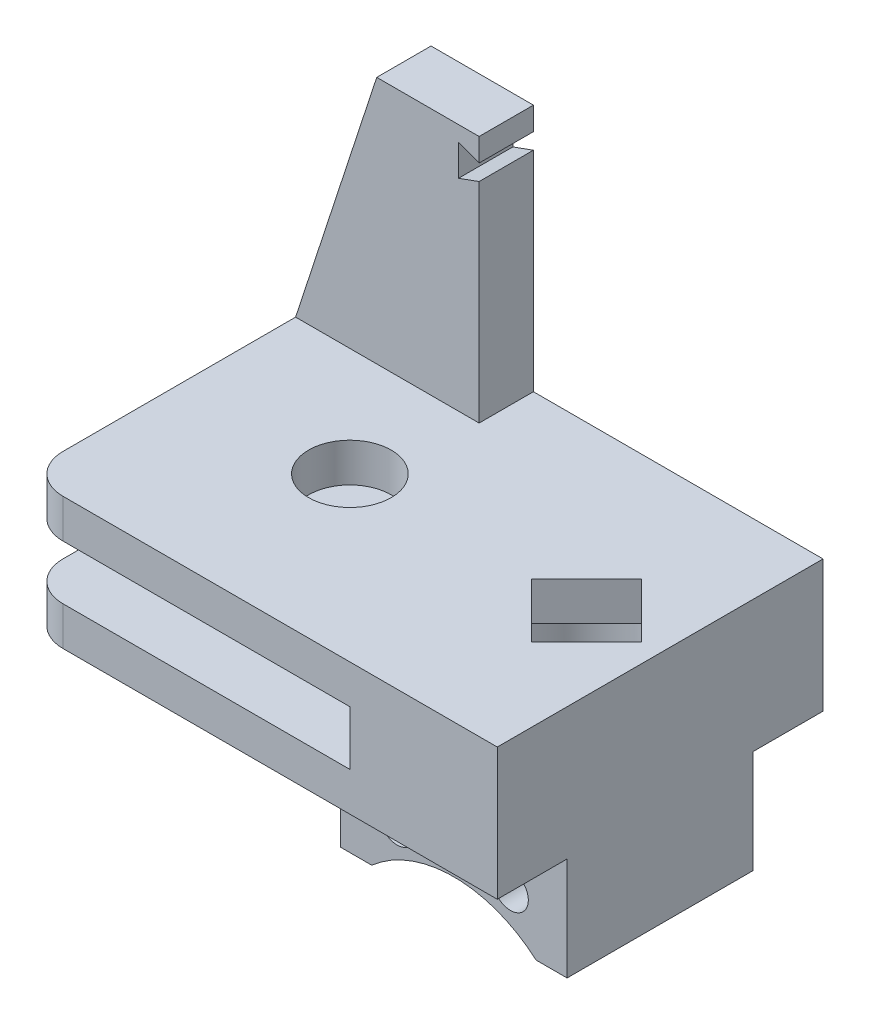
ISO-10303-21;
HEADER;
FILE_DESCRIPTION(('STEP AP214'),'2;1');
FILE_NAME('part.step','',(''),(''),'','','');
FILE_SCHEMA(('AUTOMOTIVE_DESIGN { 1 0 10303 214 1 1 1 1 }'));
ENDSEC;
DATA;
#1=APPLICATION_CONTEXT('core data for automotive mechanical design processes');
#2=APPLICATION_PROTOCOL_DEFINITION('international standard','automotive_design',2000,#1);
#3=PRODUCT_CONTEXT('',#1,'mechanical');
#4=PRODUCT('Part','Part','',(#3));
#5=PRODUCT_RELATED_PRODUCT_CATEGORY('part','',(#4));
#6=PRODUCT_DEFINITION_FORMATION('','',#4);
#7=PRODUCT_DEFINITION_CONTEXT('part definition',#1,'design');
#8=PRODUCT_DEFINITION('design','',#6,#7);
#9=PRODUCT_DEFINITION_SHAPE('','',#8);
#10=(LENGTH_UNIT() NAMED_UNIT(*) SI_UNIT(.MILLI.,.METRE.));
#11=(NAMED_UNIT(*) PLANE_ANGLE_UNIT() SI_UNIT($,.RADIAN.));
#12=(NAMED_UNIT(*) SI_UNIT($,.STERADIAN.) SOLID_ANGLE_UNIT());
#13=UNCERTAINTY_MEASURE_WITH_UNIT(LENGTH_MEASURE(1.E-05),#10,'distance_accuracy_value','');
#14=(GEOMETRIC_REPRESENTATION_CONTEXT(3) GLOBAL_UNCERTAINTY_ASSIGNED_CONTEXT((#13)) GLOBAL_UNIT_ASSIGNED_CONTEXT((#10,
#11,#12)) REPRESENTATION_CONTEXT('',''));
#15=CARTESIAN_POINT('',(0.,0.,0.));
#16=DIRECTION('',(0.,0.,1.));
#17=DIRECTION('',(1.,0.,0.));
#18=AXIS2_PLACEMENT_3D('',#15,#16,#17);
#19=CARTESIAN_POINT('',(1.6891,23.495,-13.335));
#20=DIRECTION('',(-1.,0.,0.));
#21=DIRECTION('',(0.,0.,1.));
#22=AXIS2_PLACEMENT_3D('',#19,#20,#21);
#23=PLANE('',#22);
#24=DIRECTION('',(0.,-1.,0.));
#25=VECTOR('',#24,1.);
#26=CARTESIAN_POINT('',(1.6891,23.495,-8.89));
#27=LINE('',#26,#25);
#28=CARTESIAN_POINT('',(1.6891,23.495,-8.89));
#29=VERTEX_POINT('',#28);
#30=CARTESIAN_POINT('',(1.6891,21.610217877301,-8.89));
#31=VERTEX_POINT('',#30);
#32=EDGE_CURVE('E244',#29,#31,#27,.T.);
#33=ORIENTED_EDGE('',*,*,#32,.T.);
#34=DIRECTION('',(0.,0.,1.));
#35=VECTOR('',#34,1.);
#36=CARTESIAN_POINT('',(1.6891,21.610217877301,-21.59));
#37=LINE('',#36,#35);
#38=CARTESIAN_POINT('',(1.6891,21.610217877301,-13.335));
#39=VERTEX_POINT('',#38);
#40=EDGE_CURVE('E238',#39,#31,#37,.T.);
#41=ORIENTED_EDGE('',*,*,#40,.F.);
#42=DIRECTION('',(0.,-1.,0.));
#43=VECTOR('',#42,1.);
#44=CARTESIAN_POINT('',(1.6891,23.495,-13.335));
#45=LINE('',#44,#43);
#46=CARTESIAN_POINT('',(1.6891,23.495,-13.335));
#47=VERTEX_POINT('',#46);
#48=EDGE_CURVE('E253',#47,#39,#45,.T.);
#49=ORIENTED_EDGE('',*,*,#48,.F.);
#50=DIRECTION('',(0.,0.,-1.));
#51=VECTOR('',#50,1.);
#52=CARTESIAN_POINT('',(1.6891,23.495,-13.335));
#53=LINE('',#52,#51);
#54=EDGE_CURVE('E839',#29,#47,#53,.T.);
#55=ORIENTED_EDGE('',*,*,#54,.F.);
#56=EDGE_LOOP('',(#33,#41,#49,#55));
#57=FACE_BOUND('',#56,.T.);
#58=ADVANCED_FACE('F37',(#57),#23,.F.);
#59=CARTESIAN_POINT('',(0.,3.175,0.));
#60=DIRECTION('',(0.,1.,0.));
#61=DIRECTION('',(0.,0.,1.));
#62=AXIS2_PLACEMENT_3D('',#59,#60,#61);
#63=PLANE('',#62);
#64=DIRECTION('',(-0.705213204342348,0.,0.708995300704594));
#65=VECTOR('',#64,1.);
#66=CARTESIAN_POINT('',(14.8774361673927,3.175,0.0240162260162808));
#67=LINE('',#66,#65);
#68=CARTESIAN_POINT('',(19.3675,3.175,-4.49012806053455));
#69=VERTEX_POINT('',#68);
#70=CARTESIAN_POINT('',(14.8774361673927,3.175,0.024016226016282));
#71=VERTEX_POINT('',#70);
#72=EDGE_CURVE('E290',#69,#71,#67,.T.);
#73=ORIENTED_EDGE('',*,*,#72,.F.);
#74=DIRECTION('',(-0.708995300704597,0.,-0.705213204342345));
#75=VECTOR('',#74,1.);
#76=CARTESIAN_POINT('',(23.8575638326073,3.175,-0.0240162260162793));
#77=LINE('',#76,#75);
#78=CARTESIAN_POINT('',(23.8575638326073,3.175,-0.0240162260162793));
#79=VERTEX_POINT('',#78);
#80=EDGE_CURVE('E299',#79,#69,#77,.T.);
#81=ORIENTED_EDGE('',*,*,#80,.F.);
#82=DIRECTION('',(0.705213204342346,0.,-0.708995300704596));
#83=VECTOR('',#82,1.);
#84=CARTESIAN_POINT('',(19.3675,3.175,4.49012806053458));
#85=LINE('',#84,#83);
#86=CARTESIAN_POINT('',(19.3675,3.175,4.49012806053458));
#87=VERTEX_POINT('',#86);
#88=EDGE_CURVE('E296',#87,#79,#85,.T.);
#89=ORIENTED_EDGE('',*,*,#88,.F.);
#90=DIRECTION('',(0.708995300704596,0.,0.705213204342346));
#91=VECTOR('',#90,1.);
#92=CARTESIAN_POINT('',(19.3675,3.175,4.49012806053458));
#93=LINE('',#92,#91);
#94=EDGE_CURVE('E293',#71,#87,#93,.T.);
#95=ORIENTED_EDGE('',*,*,#94,.F.);
#96=EDGE_LOOP('',(#73,#81,#89,#95));
#97=FACE_BOUND('',#96,.T.);
#98=CARTESIAN_POINT('',(0.,3.175,0.));
#99=DIRECTION('',(0.,1.,0.));
#100=DIRECTION('',(0.,0.,1.));
#101=AXIS2_PLACEMENT_3D('',#98,#99,#100);
#102=CIRCLE('',#101,3.3782);
#103=CARTESIAN_POINT('',(0.,3.175,3.3782));
#104=VERTEX_POINT('',#103);
#105=EDGE_CURVE('E393',#104,#104,#102,.T.);
#106=ORIENTED_EDGE('',*,*,#105,.F.);
#107=EDGE_LOOP('',(#106));
#108=FACE_BOUND('',#107,.T.);
#109=DIRECTION('',(0.,0.,1.));
#110=VECTOR('',#109,1.);
#111=CARTESIAN_POINT('',(-13.335,3.175,13.335));
#112=LINE('',#111,#110);
#113=CARTESIAN_POINT('',(-13.335,3.175,-8.89));
#114=VERTEX_POINT('',#113);
#115=CARTESIAN_POINT('',(-13.335,3.175,10.16));
#116=VERTEX_POINT('',#115);
#117=EDGE_CURVE('E260',#114,#116,#112,.T.);
#118=ORIENTED_EDGE('',*,*,#117,.T.);
#119=CARTESIAN_POINT('',(-10.16,3.175,10.16));
#120=DIRECTION('',(0.,1.,0.));
#121=DIRECTION('',(0.,0.,1.));
#122=AXIS2_PLACEMENT_3D('',#119,#120,#121);
#123=CIRCLE('',#122,3.175);
#124=CARTESIAN_POINT('',(-10.16,3.175,13.335));
#125=VERTEX_POINT('',#124);
#126=EDGE_CURVE('E45',#116,#125,#123,.T.);
#127=ORIENTED_EDGE('',*,*,#126,.T.);
#128=DIRECTION('',(1.,0.,0.));
#129=VECTOR('',#128,1.);
#130=CARTESIAN_POINT('',(0.,3.175,13.335));
#131=LINE('',#130,#129);
#132=CARTESIAN_POINT('',(25.4,3.175,13.335));
#133=VERTEX_POINT('',#132);
#134=EDGE_CURVE('E399',#125,#133,#131,.T.);
#135=ORIENTED_EDGE('',*,*,#134,.T.);
#136=DIRECTION('',(0.,0.,1.));
#137=VECTOR('',#136,1.);
#138=CARTESIAN_POINT('',(25.4,3.175,0.));
#139=LINE('',#138,#137);
#140=CARTESIAN_POINT('',(25.4,3.175,-13.335));
#141=VERTEX_POINT('',#140);
#142=EDGE_CURVE('E401',#141,#133,#139,.T.);
#143=ORIENTED_EDGE('',*,*,#142,.F.);
#144=DIRECTION('',(1.,0.,0.));
#145=VECTOR('',#144,1.);
#146=CARTESIAN_POINT('',(0.,3.175,-13.335));
#147=LINE('',#146,#145);
#148=CARTESIAN_POINT('',(1.6891,3.175,-13.335));
#149=VERTEX_POINT('',#148);
#150=EDGE_CURVE('E396',#149,#141,#147,.T.);
#151=ORIENTED_EDGE('',*,*,#150,.F.);
#152=DIRECTION('',(0.,0.,-1.));
#153=VECTOR('',#152,1.);
#154=CARTESIAN_POINT('',(1.6891,3.175,-13.335));
#155=LINE('',#154,#153);
#156=CARTESIAN_POINT('',(1.6891,3.175,-8.89));
#157=VERTEX_POINT('',#156);
#158=EDGE_CURVE('E844',#157,#149,#155,.T.);
#159=ORIENTED_EDGE('',*,*,#158,.F.);
#160=DIRECTION('',(1.,0.,0.));
#161=VECTOR('',#160,1.);
#162=CARTESIAN_POINT('',(1.6891,3.175,-8.89));
#163=LINE('',#162,#161);
#164=EDGE_CURVE('E243',#114,#157,#163,.T.);
#165=ORIENTED_EDGE('',*,*,#164,.F.);
#166=EDGE_LOOP('',(#118,#127,#135,#143,#151,#159,#165));
#167=FACE_BOUND('',#166,.T.);
#168=ADVANCED_FACE('F437',(#97,#108,#167),#63,.T.);
#169=CARTESIAN_POINT('',(0.,-16.05915,0.));
#170=DIRECTION('',(0.,-1.,0.));
#171=DIRECTION('',(0.,0.,-1.));
#172=AXIS2_PLACEMENT_3D('',#169,#170,#171);
#173=PLANE('',#172);
#174=DIRECTION('',(0.,0.,-1.));
#175=VECTOR('',#174,1.);
#176=CARTESIAN_POINT('',(9.40879166989593,-16.05915,13.335));
#177=LINE('',#176,#175);
#178=CARTESIAN_POINT('',(9.40879166989593,-16.05915,7.62000000000001));
#179=VERTEX_POINT('',#178);
#180=CARTESIAN_POINT('',(9.40879166989593,-16.05915,-7.62));
#181=VERTEX_POINT('',#180);
#182=EDGE_CURVE('E417',#179,#181,#177,.T.);
#183=ORIENTED_EDGE('',*,*,#182,.F.);
#184=DIRECTION('',(-1.,0.,0.));
#185=VECTOR('',#184,1.);
#186=CARTESIAN_POINT('',(25.4,-16.05915,7.62000000000001));
#187=LINE('',#186,#185);
#188=CARTESIAN_POINT('',(6.858,-16.05915,7.62000000000001));
#189=VERTEX_POINT('',#188);
#190=EDGE_CURVE('E331',#179,#189,#187,.T.);
#191=ORIENTED_EDGE('',*,*,#190,.T.);
#192=DIRECTION('',(0.,0.,-1.));
#193=VECTOR('',#192,1.);
#194=CARTESIAN_POINT('',(6.858,-16.05915,-7.62000000000001));
#195=LINE('',#194,#193);
#196=CARTESIAN_POINT('',(6.858,-16.05915,-7.62000000000001));
#197=VERTEX_POINT('',#196);
#198=EDGE_CURVE('E336',#189,#197,#195,.T.);
#199=ORIENTED_EDGE('',*,*,#198,.T.);
#200=DIRECTION('',(1.,0.,0.));
#201=VECTOR('',#200,1.);
#202=CARTESIAN_POINT('',(25.4,-16.05915,-7.62));
#203=LINE('',#202,#201);
#204=EDGE_CURVE('E339',#197,#181,#203,.T.);
#205=ORIENTED_EDGE('',*,*,#204,.T.);
#206=EDGE_LOOP('',(#183,#191,#199,#205));
#207=FACE_BOUND('',#206,.T.);
#208=ADVANCED_FACE('F497',(#207),#173,.T.);
#209=CARTESIAN_POINT('',(0.,3.175,-13.335));
#210=DIRECTION('',(0.,0.,-1.));
#211=DIRECTION('',(-1.,0.,0.));
#212=AXIS2_PLACEMENT_3D('',#209,#210,#211);
#213=PLANE('',#212);
#214=DIRECTION('',(0.93969262078591,-0.342020143325665,0.));
#215=VECTOR('',#214,1.);
#216=CARTESIAN_POINT('',(6.12255198226424,19.9965733207083,-13.335));
#217=LINE('',#216,#215);
#218=CARTESIAN_POINT('',(0.,22.225,-13.335));
#219=VERTEX_POINT('',#218);
#220=EDGE_CURVE('E849',#219,#39,#217,.T.);
#221=ORIENTED_EDGE('',*,*,#220,.F.);
#222=DIRECTION('',(0.,1.,0.));
#223=VECTOR('',#222,1.);
#224=CARTESIAN_POINT('',(0.,3.175,-13.335));
#225=LINE('',#224,#223);
#226=CARTESIAN_POINT('',(0.,19.685,-13.335));
#227=VERTEX_POINT('',#226);
#228=EDGE_CURVE('E845',#227,#219,#225,.T.);
#229=ORIENTED_EDGE('',*,*,#228,.F.);
#230=DIRECTION('',(-0.939692620785907,-0.342020143325672,0.));
#231=VECTOR('',#230,1.);
#232=CARTESIAN_POINT('',(-5.30621171796243,17.7536968779471,-13.335));
#233=LINE('',#232,#231);
#234=CARTESIAN_POINT('',(1.6891,20.299782122699,-13.335));
#235=VERTEX_POINT('',#234);
#236=EDGE_CURVE('E851',#235,#227,#233,.T.);
#237=ORIENTED_EDGE('',*,*,#236,.F.);
#238=EDGE_CURVE('E237',#235,#149,#45,.T.);
#239=ORIENTED_EDGE('',*,*,#238,.T.);
#240=ORIENTED_EDGE('',*,*,#150,.T.);
#241=DIRECTION('',(0.,-1.,0.));
#242=VECTOR('',#241,1.);
#243=CARTESIAN_POINT('',(25.4,3.175,-13.335));
#244=LINE('',#243,#242);
#245=CARTESIAN_POINT('',(25.4,-7.62,-13.335));
#246=VERTEX_POINT('',#245);
#247=EDGE_CURVE('E404',#141,#246,#244,.T.);
#248=ORIENTED_EDGE('',*,*,#247,.T.);
#249=DIRECTION('',(1.,0.,0.));
#250=VECTOR('',#249,1.);
#251=CARTESIAN_POINT('',(0.,-7.62,-13.335));
#252=LINE('',#251,#250);
#253=CARTESIAN_POINT('',(-13.335,-7.62,-13.335));
#254=VERTEX_POINT('',#253);
#255=EDGE_CURVE('E365',#254,#246,#252,.T.);
#256=ORIENTED_EDGE('',*,*,#255,.F.);
#257=DIRECTION('',(0.,-1.,0.));
#258=VECTOR('',#257,1.);
#259=CARTESIAN_POINT('',(-13.335,25.3729664799597,-13.335));
#260=LINE('',#259,#258);
#261=CARTESIAN_POINT('',(-13.335,-4.445,-13.335));
#262=VERTEX_POINT('',#261);
#263=EDGE_CURVE('E261',#262,#254,#260,.T.);
#264=ORIENTED_EDGE('',*,*,#263,.F.);
#265=DIRECTION('',(1.,0.,0.));
#266=VECTOR('',#265,1.);
#267=CARTESIAN_POINT('',(0.,-4.445,-13.335));
#268=LINE('',#267,#266);
#269=CARTESIAN_POINT('',(13.335,-4.445,-13.335));
#270=VERTEX_POINT('',#269);
#271=EDGE_CURVE('E377',#262,#270,#268,.T.);
#272=ORIENTED_EDGE('',*,*,#271,.T.);
#273=DIRECTION('',(0.,1.,0.));
#274=VECTOR('',#273,1.);
#275=CARTESIAN_POINT('',(13.335,-4.445,-13.335));
#276=LINE('',#275,#274);
#277=CARTESIAN_POINT('',(13.335,0.,-13.335));
#278=VERTEX_POINT('',#277);
#279=EDGE_CURVE('E384',#270,#278,#276,.T.);
#280=ORIENTED_EDGE('',*,*,#279,.T.);
#281=DIRECTION('',(1.,0.,0.));
#282=VECTOR('',#281,1.);
#283=CARTESIAN_POINT('',(0.,0.,-13.335));
#284=LINE('',#283,#282);
#285=CARTESIAN_POINT('',(-13.335,0.,-13.335));
#286=VERTEX_POINT('',#285);
#287=EDGE_CURVE('E407',#286,#278,#284,.T.);
#288=ORIENTED_EDGE('',*,*,#287,.F.);
#289=DIRECTION('',(0.,1.,0.));
#290=VECTOR('',#289,1.);
#291=CARTESIAN_POINT('',(-13.335,-29.8179664799598,-13.335));
#292=LINE('',#291,#290);
#293=CARTESIAN_POINT('',(-13.335,3.175,-13.335));
#294=VERTEX_POINT('',#293);
#295=EDGE_CURVE('E268',#286,#294,#292,.T.);
#296=ORIENTED_EDGE('',*,*,#295,.T.);
#297=DIRECTION('',(-0.310697570966931,-0.950508821313747,0.));
#298=VECTOR('',#297,1.);
#299=CARTESIAN_POINT('',(-6.6929,23.495,-13.335));
#300=LINE('',#299,#298);
#301=CARTESIAN_POINT('',(-6.6929,23.495,-13.335));
#302=VERTEX_POINT('',#301);
#303=EDGE_CURVE('E832',#302,#294,#300,.T.);
#304=ORIENTED_EDGE('',*,*,#303,.F.);
#305=DIRECTION('',(-1.,0.,0.));
#306=VECTOR('',#305,1.);
#307=CARTESIAN_POINT('',(1.6891,23.495,-13.335));
#308=LINE('',#307,#306);
#309=EDGE_CURVE('E835',#47,#302,#308,.T.);
#310=ORIENTED_EDGE('',*,*,#309,.F.);
#311=ORIENTED_EDGE('',*,*,#48,.T.);
#312=EDGE_LOOP('',(#221,#229,#237,#239,#240,#248,#256,#264,#272,#280,#288,#296,#304,#310,#311));
#313=FACE_BOUND('',#312,.T.);
#314=ADVANCED_FACE('F453',(#313),#213,.T.);
#315=CARTESIAN_POINT('',(0.,3.175,13.335));
#316=DIRECTION('',(0.,0.,-1.));
#317=DIRECTION('',(-1.,0.,0.));
#318=AXIS2_PLACEMENT_3D('',#315,#316,#317);
#319=PLANE('',#318);
#320=DIRECTION('',(1.,0.,0.));
#321=VECTOR('',#320,1.);
#322=CARTESIAN_POINT('',(0.,-4.445,13.335));
#323=LINE('',#322,#321);
#324=CARTESIAN_POINT('',(-10.16,-4.445,13.335));
#325=VERTEX_POINT('',#324);
#326=CARTESIAN_POINT('',(13.335,-4.445,13.335));
#327=VERTEX_POINT('',#326);
#328=EDGE_CURVE('E366',#325,#327,#323,.T.);
#329=ORIENTED_EDGE('',*,*,#328,.F.);
#330=DIRECTION('',(0.,-1.,0.));
#331=VECTOR('',#330,1.);
#332=CARTESIAN_POINT('',(-10.16,-7.62,13.335));
#333=LINE('',#332,#331);
#334=CARTESIAN_POINT('',(-10.16,-7.62,13.335));
#335=VERTEX_POINT('',#334);
#336=EDGE_CURVE('E424',#325,#335,#333,.T.);
#337=ORIENTED_EDGE('',*,*,#336,.T.);
#338=DIRECTION('',(1.,0.,0.));
#339=VECTOR('',#338,1.);
#340=CARTESIAN_POINT('',(0.,-7.62,13.335));
#341=LINE('',#340,#339);
#342=CARTESIAN_POINT('',(25.4,-7.62,13.335));
#343=VERTEX_POINT('',#342);
#344=EDGE_CURVE('E372',#335,#343,#341,.T.);
#345=ORIENTED_EDGE('',*,*,#344,.T.);
#346=DIRECTION('',(0.,-1.,0.));
#347=VECTOR('',#346,1.);
#348=CARTESIAN_POINT('',(25.4,3.175,13.335));
#349=LINE('',#348,#347);
#350=EDGE_CURVE('E412',#133,#343,#349,.T.);
#351=ORIENTED_EDGE('',*,*,#350,.F.);
#352=ORIENTED_EDGE('',*,*,#134,.F.);
#353=DIRECTION('',(0.,1.,0.));
#354=VECTOR('',#353,1.);
#355=CARTESIAN_POINT('',(-10.16,0.,13.335));
#356=LINE('',#355,#354);
#357=CARTESIAN_POINT('',(-10.16,0.,13.335));
#358=VERTEX_POINT('',#357);
#359=EDGE_CURVE('E422',#125,#358,#356,.F.);
#360=ORIENTED_EDGE('',*,*,#359,.T.);
#361=DIRECTION('',(1.,0.,0.));
#362=VECTOR('',#361,1.);
#363=CARTESIAN_POINT('',(0.,0.,13.335));
#364=LINE('',#363,#362);
#365=CARTESIAN_POINT('',(13.335,0.,13.335));
#366=VERTEX_POINT('',#365);
#367=EDGE_CURVE('E397',#358,#366,#364,.T.);
#368=ORIENTED_EDGE('',*,*,#367,.T.);
#369=DIRECTION('',(0.,1.,0.));
#370=VECTOR('',#369,1.);
#371=CARTESIAN_POINT('',(13.335,-4.445,13.335));
#372=LINE('',#371,#370);
#373=EDGE_CURVE('E387',#327,#366,#372,.T.);
#374=ORIENTED_EDGE('',*,*,#373,.F.);
#375=EDGE_LOOP('',(#329,#337,#345,#351,#352,#360,#368,#374));
#376=FACE_BOUND('',#375,.T.);
#377=ADVANCED_FACE('F443',(#376),#319,.F.);
#378=CARTESIAN_POINT('',(0.,3.175,0.));
#379=DIRECTION('',(0.,-1.,0.));
#380=DIRECTION('',(0.,0.,-1.));
#381=AXIS2_PLACEMENT_3D('',#378,#379,#380);
#382=CYLINDRICAL_SURFACE('',#381,3.3782);
#383=ORIENTED_EDGE('',*,*,#105,.T.);
#384=EDGE_LOOP('',(#383));
#385=FACE_BOUND('',#384,.T.);
#386=CARTESIAN_POINT('',(0.,0.,0.));
#387=DIRECTION('',(0.,1.,0.));
#388=DIRECTION('',(0.,0.,1.));
#389=AXIS2_PLACEMENT_3D('',#386,#387,#388);
#390=CIRCLE('',#389,3.3782);
#391=CARTESIAN_POINT('',(0.,0.,3.3782));
#392=VERTEX_POINT('',#391);
#393=EDGE_CURVE('E390',#392,#392,#390,.T.);
#394=ORIENTED_EDGE('',*,*,#393,.F.);
#395=EDGE_LOOP('',(#394));
#396=FACE_BOUND('',#395,.T.);
#397=ADVANCED_FACE('F695',(#385,#396),#382,.F.);
#398=CARTESIAN_POINT('',(25.4,3.175,0.));
#399=DIRECTION('',(1.,0.,0.));
#400=DIRECTION('',(0.,0.,-1.));
#401=AXIS2_PLACEMENT_3D('',#398,#399,#400);
#402=PLANE('',#401);
#403=ORIENTED_EDGE('',*,*,#350,.T.);
#404=DIRECTION('',(0.,0.,1.));
#405=VECTOR('',#404,1.);
#406=CARTESIAN_POINT('',(25.4,-7.62,0.));
#407=LINE('',#406,#405);
#408=CARTESIAN_POINT('',(25.4,-7.62,7.62000000000001));
#409=VERTEX_POINT('',#408);
#410=EDGE_CURVE('E369',#409,#343,#407,.T.);
#411=ORIENTED_EDGE('',*,*,#410,.F.);
#412=DIRECTION('',(0.,1.,0.));
#413=VECTOR('',#412,1.);
#414=CARTESIAN_POINT('',(25.4,-16.05915,7.62000000000001));
#415=LINE('',#414,#413);
#416=CARTESIAN_POINT('',(25.4,-16.05915,7.62000000000001));
#417=VERTEX_POINT('',#416);
#418=EDGE_CURVE('E358',#417,#409,#415,.T.);
#419=ORIENTED_EDGE('',*,*,#418,.F.);
#420=DIRECTION('',(0.,0.,1.));
#421=VECTOR('',#420,1.);
#422=CARTESIAN_POINT('',(25.4,-16.05915,-7.62));
#423=LINE('',#422,#421);
#424=CARTESIAN_POINT('',(25.4,-16.05915,-7.62));
#425=VERTEX_POINT('',#424);
#426=EDGE_CURVE('E328',#425,#417,#423,.T.);
#427=ORIENTED_EDGE('',*,*,#426,.F.);
#428=DIRECTION('',(0.,1.,0.));
#429=VECTOR('',#428,1.);
#430=CARTESIAN_POINT('',(25.4,-16.05915,-7.62));
#431=LINE('',#430,#429);
#432=CARTESIAN_POINT('',(25.4,-7.62,-7.62));
#433=VERTEX_POINT('',#432);
#434=EDGE_CURVE('E342',#425,#433,#431,.T.);
#435=ORIENTED_EDGE('',*,*,#434,.T.);
#436=EDGE_CURVE('E370',#246,#433,#407,.T.);
#437=ORIENTED_EDGE('',*,*,#436,.F.);
#438=ORIENTED_EDGE('',*,*,#247,.F.);
#439=ORIENTED_EDGE('',*,*,#142,.T.);
#440=EDGE_LOOP('',(#403,#411,#419,#427,#435,#437,#438,#439));
#441=FACE_BOUND('',#440,.T.);
#442=ADVANCED_FACE('F487',(#441),#402,.T.);
#443=CARTESIAN_POINT('',(0.,0.,0.));
#444=DIRECTION('',(0.,1.,0.));
#445=DIRECTION('',(0.,0.,1.));
#446=AXIS2_PLACEMENT_3D('',#443,#444,#445);
#447=PLANE('',#446);
#448=ORIENTED_EDGE('',*,*,#367,.F.);
#449=CARTESIAN_POINT('',(-10.16,0.,10.16));
#450=DIRECTION('',(0.,1.,0.));
#451=DIRECTION('',(0.,0.,1.));
#452=AXIS2_PLACEMENT_3D('',#449,#450,#451);
#453=CIRCLE('',#452,3.175);
#454=CARTESIAN_POINT('',(-13.335,0.,10.16));
#455=VERTEX_POINT('',#454);
#456=EDGE_CURVE('E11',#358,#455,#453,.F.);
#457=ORIENTED_EDGE('',*,*,#456,.T.);
#458=DIRECTION('',(0.,0.,-1.));
#459=VECTOR('',#458,1.);
#460=CARTESIAN_POINT('',(-13.335,0.,13.335));
#461=LINE('',#460,#459);
#462=EDGE_CURVE('E265',#455,#286,#461,.T.);
#463=ORIENTED_EDGE('',*,*,#462,.T.);
#464=ORIENTED_EDGE('',*,*,#287,.T.);
#465=DIRECTION('',(0.,0.,1.));
#466=VECTOR('',#465,1.);
#467=CARTESIAN_POINT('',(13.335,0.,0.));
#468=LINE('',#467,#466);
#469=EDGE_CURVE('E374',#278,#366,#468,.T.);
#470=ORIENTED_EDGE('',*,*,#469,.T.);
#471=EDGE_LOOP('',(#448,#457,#463,#464,#470));
#472=FACE_BOUND('',#471,.T.);
#473=ORIENTED_EDGE('',*,*,#393,.T.);
#474=EDGE_LOOP('',(#473));
#475=FACE_BOUND('',#474,.T.);
#476=ADVANCED_FACE('F449',(#472,#475),#447,.F.);
#477=CARTESIAN_POINT('',(13.335,-4.445,0.));
#478=DIRECTION('',(-1.,0.,0.));
#479=DIRECTION('',(0.,0.,1.));
#480=AXIS2_PLACEMENT_3D('',#477,#478,#479);
#481=PLANE('',#480);
#482=ORIENTED_EDGE('',*,*,#469,.F.);
#483=ORIENTED_EDGE('',*,*,#279,.F.);
#484=DIRECTION('',(0.,0.,-1.));
#485=VECTOR('',#484,1.);
#486=CARTESIAN_POINT('',(13.335,-4.445,0.));
#487=LINE('',#486,#485);
#488=EDGE_CURVE('E381',#327,#270,#487,.T.);
#489=ORIENTED_EDGE('',*,*,#488,.F.);
#490=ORIENTED_EDGE('',*,*,#373,.T.);
#491=EDGE_LOOP('',(#482,#483,#489,#490));
#492=FACE_BOUND('',#491,.T.);
#493=ADVANCED_FACE('F457',(#492),#481,.T.);
#494=CARTESIAN_POINT('',(0.,-4.445,0.));
#495=DIRECTION('',(0.,-1.,0.));
#496=DIRECTION('',(0.,0.,1.));
#497=AXIS2_PLACEMENT_3D('',#494,#495,#496);
#498=PLANE('',#497);
#499=DIRECTION('',(0.,0.,1.));
#500=VECTOR('',#499,1.);
#501=CARTESIAN_POINT('',(-13.335,-4.445,-13.335));
#502=LINE('',#501,#500);
#503=CARTESIAN_POINT('',(-13.335,-4.445,10.16));
#504=VERTEX_POINT('',#503);
#505=EDGE_CURVE('E257',#262,#504,#502,.T.);
#506=ORIENTED_EDGE('',*,*,#505,.T.);
#507=CARTESIAN_POINT('',(-10.16,-4.445,10.16));
#508=DIRECTION('',(0.,-1.,0.));
#509=DIRECTION('',(0.,0.,-1.));
#510=AXIS2_PLACEMENT_3D('',#507,#508,#509);
#511=CIRCLE('',#510,3.175);
#512=EDGE_CURVE('E431',#504,#325,#511,.F.);
#513=ORIENTED_EDGE('',*,*,#512,.T.);
#514=ORIENTED_EDGE('',*,*,#328,.T.);
#515=ORIENTED_EDGE('',*,*,#488,.T.);
#516=ORIENTED_EDGE('',*,*,#271,.F.);
#517=EDGE_LOOP('',(#506,#513,#514,#515,#516));
#518=FACE_BOUND('',#517,.T.);
#519=CARTESIAN_POINT('',(0.,-4.445,0.));
#520=DIRECTION('',(0.,1.,0.));
#521=DIRECTION('',(0.,0.,1.));
#522=AXIS2_PLACEMENT_3D('',#519,#520,#521);
#523=CIRCLE('',#522,3.3782);
#524=CARTESIAN_POINT('',(0.,-4.445,3.3782));
#525=VERTEX_POINT('',#524);
#526=EDGE_CURVE('E361',#525,#525,#523,.T.);
#527=ORIENTED_EDGE('',*,*,#526,.F.);
#528=EDGE_LOOP('',(#527));
#529=FACE_BOUND('',#528,.T.);
#530=ADVANCED_FACE('F460',(#518,#529),#498,.F.);
#531=CARTESIAN_POINT('',(0.,-7.62,0.));
#532=DIRECTION('',(0.,1.,0.));
#533=DIRECTION('',(0.,0.,1.));
#534=AXIS2_PLACEMENT_3D('',#531,#532,#533);
#535=CYLINDRICAL_SURFACE('',#534,3.3782);
#536=CARTESIAN_POINT('',(0.,-7.62,0.));
#537=DIRECTION('',(0.,1.,0.));
#538=DIRECTION('',(0.,0.,1.));
#539=AXIS2_PLACEMENT_3D('',#536,#537,#538);
#540=CIRCLE('',#539,3.3782);
#541=CARTESIAN_POINT('',(0.,-7.62,3.3782));
#542=VERTEX_POINT('',#541);
#543=EDGE_CURVE('E362',#542,#542,#540,.T.);
#544=ORIENTED_EDGE('',*,*,#543,.F.);
#545=EDGE_LOOP('',(#544));
#546=FACE_BOUND('',#545,.T.);
#547=ORIENTED_EDGE('',*,*,#526,.T.);
#548=EDGE_LOOP('',(#547));
#549=FACE_BOUND('',#548,.T.);
#550=ADVANCED_FACE('F704',(#546,#549),#535,.F.);
#551=CARTESIAN_POINT('',(0.,-7.62,0.));
#552=DIRECTION('',(0.,-1.,0.));
#553=DIRECTION('',(0.,0.,1.));
#554=AXIS2_PLACEMENT_3D('',#551,#552,#553);
#555=PLANE('',#554);
#556=ORIENTED_EDGE('',*,*,#344,.F.);
#557=CARTESIAN_POINT('',(-10.16,-7.62,10.16));
#558=DIRECTION('',(0.,-1.,0.));
#559=DIRECTION('',(0.,0.,-1.));
#560=AXIS2_PLACEMENT_3D('',#557,#558,#559);
#561=CIRCLE('',#560,3.175);
#562=CARTESIAN_POINT('',(-13.335,-7.62,10.16));
#563=VERTEX_POINT('',#562);
#564=EDGE_CURVE('E427',#335,#563,#561,.T.);
#565=ORIENTED_EDGE('',*,*,#564,.T.);
#566=DIRECTION('',(0.,0.,-1.));
#567=VECTOR('',#566,1.);
#568=CARTESIAN_POINT('',(-13.335,-7.62,-13.335));
#569=LINE('',#568,#567);
#570=EDGE_CURVE('E256',#563,#254,#569,.T.);
#571=ORIENTED_EDGE('',*,*,#570,.T.);
#572=ORIENTED_EDGE('',*,*,#255,.T.);
#573=ORIENTED_EDGE('',*,*,#436,.T.);
#574=DIRECTION('',(1.,0.,0.));
#575=VECTOR('',#574,1.);
#576=CARTESIAN_POINT('',(25.4,-7.62,-7.62));
#577=LINE('',#576,#575);
#578=CARTESIAN_POINT('',(6.858,-7.62,-7.62000000000001));
#579=VERTEX_POINT('',#578);
#580=EDGE_CURVE('E332',#579,#433,#577,.T.);
#581=ORIENTED_EDGE('',*,*,#580,.F.);
#582=DIRECTION('',(0.,0.,-1.));
#583=VECTOR('',#582,1.);
#584=CARTESIAN_POINT('',(6.858,-7.62,-7.62000000000001));
#585=LINE('',#584,#583);
#586=CARTESIAN_POINT('',(6.858,-7.62,7.62000000000001));
#587=VERTEX_POINT('',#586);
#588=EDGE_CURVE('E345',#587,#579,#585,.T.);
#589=ORIENTED_EDGE('',*,*,#588,.F.);
#590=DIRECTION('',(-1.,0.,0.));
#591=VECTOR('',#590,1.);
#592=CARTESIAN_POINT('',(25.4,-7.62,7.62000000000001));
#593=LINE('',#592,#591);
#594=EDGE_CURVE('E327',#409,#587,#593,.T.);
#595=ORIENTED_EDGE('',*,*,#594,.F.);
#596=ORIENTED_EDGE('',*,*,#410,.T.);
#597=EDGE_LOOP('',(#556,#565,#571,#572,#573,#581,#589,#595,#596));
#598=FACE_BOUND('',#597,.T.);
#599=ORIENTED_EDGE('',*,*,#543,.T.);
#600=EDGE_LOOP('',(#599));
#601=FACE_BOUND('',#600,.T.);
#602=ADVANCED_FACE('F471',(#598,#601),#555,.T.);
#603=CARTESIAN_POINT('',(25.4,-16.05915,7.62000000000001));
#604=DIRECTION('',(0.,0.,-1.));
#605=DIRECTION('',(-1.,0.,0.));
#606=AXIS2_PLACEMENT_3D('',#603,#604,#605);
#607=PLANE('',#606);
#608=CARTESIAN_POINT('',(20.7645,-12.1285,7.62000000000001));
#609=DIRECTION('',(0.,0.,-1.));
#610=DIRECTION('',(-1.,0.,0.));
#611=AXIS2_PLACEMENT_3D('',#608,#609,#610);
#612=CIRCLE('',#611,1.4605);
#613=CARTESIAN_POINT('',(19.304,-12.1285,7.62000000000001));
#614=VERTEX_POINT('',#613);
#615=EDGE_CURVE('E324',#614,#614,#612,.T.);
#616=ORIENTED_EDGE('',*,*,#615,.T.);
#617=EDGE_LOOP('',(#616));
#618=FACE_BOUND('',#617,.T.);
#619=CARTESIAN_POINT('',(11.4935,-12.1285,7.62000000000001));
#620=DIRECTION('',(0.,0.,-1.));
#621=DIRECTION('',(-1.,0.,0.));
#622=AXIS2_PLACEMENT_3D('',#619,#620,#621);
#623=CIRCLE('',#622,1.4605);
#624=CARTESIAN_POINT('',(10.033,-12.1285,7.62000000000001));
#625=VERTEX_POINT('',#624);
#626=EDGE_CURVE('E319',#625,#625,#623,.T.);
#627=ORIENTED_EDGE('',*,*,#626,.T.);
#628=EDGE_LOOP('',(#627));
#629=FACE_BOUND('',#628,.T.);
#630=ORIENTED_EDGE('',*,*,#190,.F.);
#631=CARTESIAN_POINT('',(16.129,-23.67915,7.62000000000001));
#632=DIRECTION('',(0.,0.,-1.));
#633=DIRECTION('',(-1.,0.,0.));
#634=AXIS2_PLACEMENT_3D('',#631,#632,#633);
#635=CIRCLE('',#634,10.16);
#636=CARTESIAN_POINT('',(22.8492083301041,-16.05915,7.62000000000001));
#637=VERTEX_POINT('',#636);
#638=EDGE_CURVE('E312',#179,#637,#635,.T.);
#639=ORIENTED_EDGE('',*,*,#638,.T.);
#640=EDGE_CURVE('E333',#417,#637,#187,.T.);
#641=ORIENTED_EDGE('',*,*,#640,.F.);
#642=ORIENTED_EDGE('',*,*,#418,.T.);
#643=ORIENTED_EDGE('',*,*,#594,.T.);
#644=DIRECTION('',(0.,1.,0.));
#645=VECTOR('',#644,1.);
#646=CARTESIAN_POINT('',(6.858,-16.05915,7.62000000000001));
#647=LINE('',#646,#645);
#648=EDGE_CURVE('E355',#189,#587,#647,.T.);
#649=ORIENTED_EDGE('',*,*,#648,.F.);
#650=EDGE_LOOP('',(#630,#639,#641,#642,#643,#649));
#651=FACE_BOUND('',#650,.T.);
#652=ADVANCED_FACE('F504',(#618,#629,#651),#607,.F.);
#653=CARTESIAN_POINT('',(6.858,-16.05915,-7.62000000000001));
#654=DIRECTION('',(1.,0.,0.));
#655=DIRECTION('',(0.,0.,-1.));
#656=AXIS2_PLACEMENT_3D('',#653,#654,#655);
#657=PLANE('',#656);
#658=ORIENTED_EDGE('',*,*,#588,.T.);
#659=DIRECTION('',(0.,1.,0.));
#660=VECTOR('',#659,1.);
#661=CARTESIAN_POINT('',(6.858,-16.05915,-7.62000000000001));
#662=LINE('',#661,#660);
#663=EDGE_CURVE('E352',#197,#579,#662,.T.);
#664=ORIENTED_EDGE('',*,*,#663,.F.);
#665=ORIENTED_EDGE('',*,*,#198,.F.);
#666=ORIENTED_EDGE('',*,*,#648,.T.);
#667=EDGE_LOOP('',(#658,#664,#665,#666));
#668=FACE_BOUND('',#667,.T.);
#669=ADVANCED_FACE('F502',(#668),#657,.F.);
#670=CARTESIAN_POINT('',(25.4,-16.05915,-7.62));
#671=DIRECTION('',(0.,0.,1.));
#672=DIRECTION('',(1.,0.,0.));
#673=AXIS2_PLACEMENT_3D('',#670,#671,#672);
#674=PLANE('',#673);
#675=CARTESIAN_POINT('',(20.7645,-12.1285,-7.62));
#676=DIRECTION('',(0.,0.,-1.));
#677=DIRECTION('',(-1.,0.,0.));
#678=AXIS2_PLACEMENT_3D('',#675,#676,#677);
#679=CIRCLE('',#678,1.4605);
#680=CARTESIAN_POINT('',(19.304,-12.1285,-7.62));
#681=VERTEX_POINT('',#680);
#682=EDGE_CURVE('E316',#681,#681,#679,.T.);
#683=ORIENTED_EDGE('',*,*,#682,.F.);
#684=EDGE_LOOP('',(#683));
#685=FACE_BOUND('',#684,.T.);
#686=CARTESIAN_POINT('',(11.4935,-12.1285,-7.62));
#687=DIRECTION('',(0.,0.,-1.));
#688=DIRECTION('',(1.,0.,0.));
#689=AXIS2_PLACEMENT_3D('',#686,#687,#688);
#690=CIRCLE('',#689,1.4605);
#691=CARTESIAN_POINT('',(12.954,-12.1285,-7.62));
#692=VERTEX_POINT('',#691);
#693=EDGE_CURVE('E315',#692,#692,#690,.T.);
#694=ORIENTED_EDGE('',*,*,#693,.F.);
#695=EDGE_LOOP('',(#694));
#696=FACE_BOUND('',#695,.T.);
#697=CARTESIAN_POINT('',(22.8492083301041,-16.05915,-7.62));
#698=VERTEX_POINT('',#697);
#699=EDGE_CURVE('E338',#698,#425,#203,.T.);
#700=ORIENTED_EDGE('',*,*,#699,.F.);
#701=CARTESIAN_POINT('',(16.129,-23.67915,-7.62));
#702=DIRECTION('',(0.,0.,-1.));
#703=DIRECTION('',(-1.,0.,0.));
#704=AXIS2_PLACEMENT_3D('',#701,#702,#703);
#705=CIRCLE('',#704,10.16);
#706=EDGE_CURVE('E305',#181,#698,#705,.T.);
#707=ORIENTED_EDGE('',*,*,#706,.F.);
#708=ORIENTED_EDGE('',*,*,#204,.F.);
#709=ORIENTED_EDGE('',*,*,#663,.T.);
#710=ORIENTED_EDGE('',*,*,#580,.T.);
#711=ORIENTED_EDGE('',*,*,#434,.F.);
#712=EDGE_LOOP('',(#700,#707,#708,#709,#710,#711));
#713=FACE_BOUND('',#712,.T.);
#714=ADVANCED_FACE('F483',(#685,#696,#713),#674,.F.);
#715=DIRECTION('',(0.,0.,-1.));
#716=VECTOR('',#715,1.);
#717=CARTESIAN_POINT('',(22.8492083301041,-16.05915,13.335));
#718=LINE('',#717,#716);
#719=EDGE_CURVE('E415',#698,#637,#718,.F.);
#720=ORIENTED_EDGE('',*,*,#719,.F.);
#721=ORIENTED_EDGE('',*,*,#699,.T.);
#722=ORIENTED_EDGE('',*,*,#426,.T.);
#723=ORIENTED_EDGE('',*,*,#640,.T.);
#724=EDGE_LOOP('',(#720,#721,#722,#723));
#725=FACE_BOUND('',#724,.T.);
#726=ADVANCED_FACE('F492',(#725),#173,.T.);
#727=CARTESIAN_POINT('',(11.4935,-12.1285,13.335));
#728=DIRECTION('',(0.,0.,-1.));
#729=DIRECTION('',(-1.,0.,0.));
#730=AXIS2_PLACEMENT_3D('',#727,#728,#729);
#731=CYLINDRICAL_SURFACE('',#730,1.4605);
#732=ORIENTED_EDGE('',*,*,#693,.T.);
#733=EDGE_LOOP('',(#732));
#734=FACE_BOUND('',#733,.T.);
#735=ORIENTED_EDGE('',*,*,#626,.F.);
#736=EDGE_LOOP('',(#735));
#737=FACE_BOUND('',#736,.T.);
#738=ADVANCED_FACE('F517',(#734,#737),#731,.F.);
#739=CARTESIAN_POINT('',(20.7645,-12.1285,13.335));
#740=DIRECTION('',(0.,0.,-1.));
#741=DIRECTION('',(-1.,0.,0.));
#742=AXIS2_PLACEMENT_3D('',#739,#740,#741);
#743=CYLINDRICAL_SURFACE('',#742,1.4605);
#744=ORIENTED_EDGE('',*,*,#682,.T.);
#745=EDGE_LOOP('',(#744));
#746=FACE_BOUND('',#745,.T.);
#747=ORIENTED_EDGE('',*,*,#615,.F.);
#748=EDGE_LOOP('',(#747));
#749=FACE_BOUND('',#748,.T.);
#750=ADVANCED_FACE('F508',(#746,#749),#743,.F.);
#751=CARTESIAN_POINT('',(16.129,-23.67915,13.335));
#752=DIRECTION('',(0.,0.,-1.));
#753=DIRECTION('',(-1.,0.,0.));
#754=AXIS2_PLACEMENT_3D('',#751,#752,#753);
#755=CYLINDRICAL_SURFACE('',#754,10.16);
#756=ORIENTED_EDGE('',*,*,#182,.T.);
#757=ORIENTED_EDGE('',*,*,#706,.T.);
#758=ORIENTED_EDGE('',*,*,#719,.T.);
#759=ORIENTED_EDGE('',*,*,#638,.F.);
#760=EDGE_LOOP('',(#756,#757,#758,#759));
#761=FACE_BOUND('',#760,.T.);
#762=ADVANCED_FACE('F505',(#761),#755,.F.);
#763=CARTESIAN_POINT('',(14.8774361673927,-6.35,0.0240162260162808));
#764=DIRECTION('',(-0.708995300704594,0.,-0.705213204342348));
#765=DIRECTION('',(-0.705213204342348,0.,0.708995300704594));
#766=AXIS2_PLACEMENT_3D('',#763,#764,#765);
#767=PLANE('',#766);
#768=DIRECTION('',(0.,1.,0.));
#769=VECTOR('',#768,1.);
#770=CARTESIAN_POINT('',(14.8774361673927,-6.35,0.0240162260162808));
#771=LINE('',#770,#769);
#772=CARTESIAN_POINT('',(14.8774361673927,0.,0.0240162260162808));
#773=VERTEX_POINT('',#772);
#774=EDGE_CURVE('E302',#773,#71,#771,.T.);
#775=ORIENTED_EDGE('',*,*,#774,.F.);
#776=DIRECTION('',(0.705213204342348,0.,-0.708995300704594));
#777=VECTOR('',#776,1.);
#778=CARTESIAN_POINT('',(14.8774361673927,0.,0.0240162260162808));
#779=LINE('',#778,#777);
#780=CARTESIAN_POINT('',(19.3675,0.,-4.49012806053455));
#781=VERTEX_POINT('',#780);
#782=EDGE_CURVE('E287',#773,#781,#779,.T.);
#783=ORIENTED_EDGE('',*,*,#782,.T.);
#784=DIRECTION('',(0.,1.,0.));
#785=VECTOR('',#784,1.);
#786=CARTESIAN_POINT('',(19.3675,-6.35,-4.49012806053455));
#787=LINE('',#786,#785);
#788=EDGE_CURVE('E303',#781,#69,#787,.T.);
#789=ORIENTED_EDGE('',*,*,#788,.T.);
#790=ORIENTED_EDGE('',*,*,#72,.T.);
#791=EDGE_LOOP('',(#775,#783,#789,#790));
#792=FACE_BOUND('',#791,.T.);
#793=ADVANCED_FACE('F507',(#792),#767,.F.);
#794=CARTESIAN_POINT('',(23.8575638326073,-6.35,-0.0240162260162793));
#795=DIRECTION('',(0.705213204342345,0.,-0.708995300704597));
#796=DIRECTION('',(-0.708995300704597,0.,-0.705213204342345));
#797=AXIS2_PLACEMENT_3D('',#794,#795,#796);
#798=PLANE('',#797);
#799=ORIENTED_EDGE('',*,*,#788,.F.);
#800=DIRECTION('',(0.708995300704597,0.,0.705213204342345));
#801=VECTOR('',#800,1.);
#802=CARTESIAN_POINT('',(23.8575638326073,0.,-0.0240162260162793));
#803=LINE('',#802,#801);
#804=CARTESIAN_POINT('',(23.8575638326073,0.,-0.0240162260162569));
#805=VERTEX_POINT('',#804);
#806=EDGE_CURVE('E284',#781,#805,#803,.T.);
#807=ORIENTED_EDGE('',*,*,#806,.T.);
#808=DIRECTION('',(0.,1.,0.));
#809=VECTOR('',#808,1.);
#810=CARTESIAN_POINT('',(23.8575638326073,-6.35,-0.0240162260162793));
#811=LINE('',#810,#809);
#812=EDGE_CURVE('E306',#805,#79,#811,.T.);
#813=ORIENTED_EDGE('',*,*,#812,.T.);
#814=ORIENTED_EDGE('',*,*,#80,.T.);
#815=EDGE_LOOP('',(#799,#807,#813,#814));
#816=FACE_BOUND('',#815,.T.);
#817=ADVANCED_FACE('F514',(#816),#798,.F.);
#818=CARTESIAN_POINT('',(19.3675,-6.35,4.49012806053458));
#819=DIRECTION('',(0.708995300704596,0.,0.705213204342346));
#820=DIRECTION('',(0.705213204342346,0.,-0.708995300704596));
#821=AXIS2_PLACEMENT_3D('',#818,#819,#820);
#822=PLANE('',#821);
#823=ORIENTED_EDGE('',*,*,#812,.F.);
#824=DIRECTION('',(-0.705213204342346,0.,0.708995300704596));
#825=VECTOR('',#824,1.);
#826=CARTESIAN_POINT('',(19.3675,0.,4.49012806053458));
#827=LINE('',#826,#825);
#828=CARTESIAN_POINT('',(19.3675,0.,4.49012806053455));
#829=VERTEX_POINT('',#828);
#830=EDGE_CURVE('E277',#805,#829,#827,.T.);
#831=ORIENTED_EDGE('',*,*,#830,.T.);
#832=DIRECTION('',(0.,1.,0.));
#833=VECTOR('',#832,1.);
#834=CARTESIAN_POINT('',(19.3675,-6.35,4.49012806053458));
#835=LINE('',#834,#833);
#836=EDGE_CURVE('E308',#829,#87,#835,.T.);
#837=ORIENTED_EDGE('',*,*,#836,.T.);
#838=ORIENTED_EDGE('',*,*,#88,.T.);
#839=EDGE_LOOP('',(#823,#831,#837,#838));
#840=FACE_BOUND('',#839,.T.);
#841=ADVANCED_FACE('F558',(#840),#822,.F.);
#842=CARTESIAN_POINT('',(19.3675,-6.35,4.49012806053458));
#843=DIRECTION('',(-0.705213204342346,0.,0.708995300704596));
#844=DIRECTION('',(0.708995300704596,0.,0.705213204342346));
#845=AXIS2_PLACEMENT_3D('',#842,#843,#844);
#846=PLANE('',#845);
#847=ORIENTED_EDGE('',*,*,#836,.F.);
#848=DIRECTION('',(-0.708995300704596,0.,-0.705213204342346));
#849=VECTOR('',#848,1.);
#850=CARTESIAN_POINT('',(19.3675,0.,4.49012806053458));
#851=LINE('',#850,#849);
#852=EDGE_CURVE('E419',#829,#773,#851,.T.);
#853=ORIENTED_EDGE('',*,*,#852,.T.);
#854=ORIENTED_EDGE('',*,*,#774,.T.);
#855=ORIENTED_EDGE('',*,*,#94,.T.);
#856=EDGE_LOOP('',(#847,#853,#854,#855));
#857=FACE_BOUND('',#856,.T.);
#858=ADVANCED_FACE('F546',(#857),#846,.F.);
#859=CARTESIAN_POINT('',(19.3675,0.,0.));
#860=DIRECTION('',(0.,1.,0.));
#861=DIRECTION('',(0.,0.,1.));
#862=AXIS2_PLACEMENT_3D('',#859,#860,#861);
#863=PLANE('',#862);
#864=CARTESIAN_POINT('',(19.3675,0.,0.));
#865=DIRECTION('',(0.,1.,0.));
#866=DIRECTION('',(0.,0.,1.));
#867=AXIS2_PLACEMENT_3D('',#864,#865,#866);
#868=CIRCLE('',#867,4.49012806053455);
#869=EDGE_CURVE('E581',#781,#773,#868,.T.);
#870=ORIENTED_EDGE('',*,*,#869,.F.);
#871=ORIENTED_EDGE('',*,*,#782,.F.);
#872=EDGE_LOOP('',(#870,#871));
#873=FACE_BOUND('',#872,.T.);
#874=ADVANCED_FACE('F542',(#873),#863,.F.);
#875=EDGE_CURVE('E278',#805,#781,#868,.T.);
#876=ORIENTED_EDGE('',*,*,#875,.F.);
#877=ORIENTED_EDGE('',*,*,#806,.F.);
#878=EDGE_LOOP('',(#876,#877));
#879=FACE_BOUND('',#878,.T.);
#880=ADVANCED_FACE('F545',(#879),#863,.F.);
#881=EDGE_CURVE('E274',#829,#805,#868,.T.);
#882=ORIENTED_EDGE('',*,*,#881,.F.);
#883=ORIENTED_EDGE('',*,*,#830,.F.);
#884=EDGE_LOOP('',(#882,#883));
#885=FACE_BOUND('',#884,.T.);
#886=ADVANCED_FACE('F576',(#885),#863,.F.);
#887=EDGE_CURVE('E279',#773,#829,#868,.T.);
#888=ORIENTED_EDGE('',*,*,#887,.F.);
#889=ORIENTED_EDGE('',*,*,#852,.F.);
#890=EDGE_LOOP('',(#888,#889));
#891=FACE_BOUND('',#890,.T.);
#892=ADVANCED_FACE('F548',(#891),#863,.F.);
#893=CARTESIAN_POINT('',(19.3675,0.,0.));
#894=DIRECTION('',(0.,-1.,0.));
#895=DIRECTION('',(0.,0.,-1.));
#896=AXIS2_PLACEMENT_3D('',#893,#894,#895);
#897=CYLINDRICAL_SURFACE('',#896,4.49012806053455);
#898=CARTESIAN_POINT('',(19.3675,-6.35,0.));
#899=DIRECTION('',(0.,1.,0.));
#900=DIRECTION('',(0.,0.,1.));
#901=AXIS2_PLACEMENT_3D('',#898,#899,#900);
#902=CIRCLE('',#901,4.49012806053455);
#903=CARTESIAN_POINT('',(19.3675,-6.35,4.49012806053455));
#904=VERTEX_POINT('',#903);
#905=EDGE_CURVE('E267',#904,#904,#902,.T.);
#906=ORIENTED_EDGE('',*,*,#905,.F.);
#907=EDGE_LOOP('',(#906));
#908=FACE_BOUND('',#907,.T.);
#909=ORIENTED_EDGE('',*,*,#875,.T.);
#910=ORIENTED_EDGE('',*,*,#869,.T.);
#911=ORIENTED_EDGE('',*,*,#887,.T.);
#912=ORIENTED_EDGE('',*,*,#881,.T.);
#913=EDGE_LOOP('',(#909,#910,#911,#912));
#914=FACE_BOUND('',#913,.T.);
#915=ADVANCED_FACE('F549',(#908,#914),#897,.F.);
#916=CARTESIAN_POINT('',(0.,-6.35,0.));
#917=DIRECTION('',(0.,1.,0.));
#918=DIRECTION('',(0.,0.,1.));
#919=AXIS2_PLACEMENT_3D('',#916,#917,#918);
#920=PLANE('',#919);
#921=ORIENTED_EDGE('',*,*,#905,.T.);
#922=EDGE_LOOP('',(#921));
#923=FACE_BOUND('',#922,.T.);
#924=ADVANCED_FACE('F539',(#923),#920,.T.);
#925=CARTESIAN_POINT('',(-13.335,-29.8179664799598,13.335));
#926=DIRECTION('',(-1.,0.,0.));
#927=DIRECTION('',(0.,0.,1.));
#928=AXIS2_PLACEMENT_3D('',#925,#926,#927);
#929=PLANE('',#928);
#930=ORIENTED_EDGE('',*,*,#462,.F.);
#931=DIRECTION('',(0.,1.,0.));
#932=VECTOR('',#931,1.);
#933=CARTESIAN_POINT('',(-13.335,3.175,10.16));
#934=LINE('',#933,#932);
#935=EDGE_CURVE('E433',#455,#116,#934,.T.);
#936=ORIENTED_EDGE('',*,*,#935,.T.);
#937=ORIENTED_EDGE('',*,*,#117,.F.);
#938=EDGE_CURVE('E269',#294,#114,#112,.T.);
#939=ORIENTED_EDGE('',*,*,#938,.F.);
#940=ORIENTED_EDGE('',*,*,#295,.F.);
#941=EDGE_LOOP('',(#930,#936,#937,#939,#940));
#942=FACE_BOUND('',#941,.T.);
#943=ADVANCED_FACE('F445',(#942),#929,.T.);
#944=CARTESIAN_POINT('',(-13.335,25.3729664799597,-13.335));
#945=DIRECTION('',(-1.,0.,0.));
#946=DIRECTION('',(0.,0.,1.));
#947=AXIS2_PLACEMENT_3D('',#944,#945,#946);
#948=PLANE('',#947);
#949=ORIENTED_EDGE('',*,*,#570,.F.);
#950=DIRECTION('',(0.,-1.,0.));
#951=VECTOR('',#950,1.);
#952=CARTESIAN_POINT('',(-13.335,-4.445,10.16));
#953=LINE('',#952,#951);
#954=EDGE_CURVE('E429',#563,#504,#953,.F.);
#955=ORIENTED_EDGE('',*,*,#954,.T.);
#956=ORIENTED_EDGE('',*,*,#505,.F.);
#957=ORIENTED_EDGE('',*,*,#263,.T.);
#958=EDGE_LOOP('',(#949,#955,#956,#957));
#959=FACE_BOUND('',#958,.T.);
#960=ADVANCED_FACE('F476',(#959),#948,.T.);
#961=ORIENTED_EDGE('',*,*,#238,.F.);
#962=DIRECTION('',(0.,0.,1.));
#963=VECTOR('',#962,1.);
#964=CARTESIAN_POINT('',(1.6891,20.299782122699,-21.59));
#965=LINE('',#964,#963);
#966=CARTESIAN_POINT('',(1.6891,20.299782122699,-8.89));
#967=VERTEX_POINT('',#966);
#968=EDGE_CURVE('E221',#235,#967,#965,.T.);
#969=ORIENTED_EDGE('',*,*,#968,.T.);
#970=EDGE_CURVE('E235',#967,#157,#27,.T.);
#971=ORIENTED_EDGE('',*,*,#970,.T.);
#972=ORIENTED_EDGE('',*,*,#158,.T.);
#973=EDGE_LOOP('',(#961,#969,#971,#972));
#974=FACE_BOUND('',#973,.T.);
#975=ADVANCED_FACE('F233',(#974),#23,.F.);
#976=CARTESIAN_POINT('',(1.6891,23.495,-8.89));
#977=DIRECTION('',(0.,0.,-1.));
#978=DIRECTION('',(-1.,0.,0.));
#979=AXIS2_PLACEMENT_3D('',#976,#977,#978);
#980=PLANE('',#979);
#981=DIRECTION('',(0.,-1.,0.));
#982=VECTOR('',#981,1.);
#983=CARTESIAN_POINT('',(0.,22.225,-8.89));
#984=LINE('',#983,#982);
#985=CARTESIAN_POINT('',(0.,22.225,-8.89));
#986=VERTEX_POINT('',#985);
#987=CARTESIAN_POINT('',(0.,19.685,-8.89));
#988=VERTEX_POINT('',#987);
#989=EDGE_CURVE('E229',#986,#988,#984,.T.);
#990=ORIENTED_EDGE('',*,*,#989,.F.);
#991=DIRECTION('',(-0.93969262078591,0.342020143325665,0.));
#992=VECTOR('',#991,1.);
#993=CARTESIAN_POINT('',(0.,22.225,-8.89));
#994=LINE('',#993,#992);
#995=EDGE_CURVE('E228',#31,#986,#994,.T.);
#996=ORIENTED_EDGE('',*,*,#995,.F.);
#997=ORIENTED_EDGE('',*,*,#32,.F.);
#998=DIRECTION('',(1.,0.,0.));
#999=VECTOR('',#998,1.);
#1000=CARTESIAN_POINT('',(1.6891,23.495,-8.89));
#1001=LINE('',#1000,#999);
#1002=CARTESIAN_POINT('',(-6.6929,23.495,-8.89));
#1003=VERTEX_POINT('',#1002);
#1004=EDGE_CURVE('E245',#1003,#29,#1001,.T.);
#1005=ORIENTED_EDGE('',*,*,#1004,.F.);
#1006=DIRECTION('',(-0.310697570966931,-0.950508821313747,0.));
#1007=VECTOR('',#1006,1.);
#1008=CARTESIAN_POINT('',(-6.6929,23.495,-8.89));
#1009=LINE('',#1008,#1007);
#1010=EDGE_CURVE('E833',#1003,#114,#1009,.T.);
#1011=ORIENTED_EDGE('',*,*,#1010,.T.);
#1012=ORIENTED_EDGE('',*,*,#164,.T.);
#1013=ORIENTED_EDGE('',*,*,#970,.F.);
#1014=DIRECTION('',(0.939692620785907,0.342020143325672,0.));
#1015=VECTOR('',#1014,1.);
#1016=CARTESIAN_POINT('',(0.,19.685,-8.89));
#1017=LINE('',#1016,#1015);
#1018=EDGE_CURVE('E218',#988,#967,#1017,.T.);
#1019=ORIENTED_EDGE('',*,*,#1018,.F.);
#1020=EDGE_LOOP('',(#990,#996,#997,#1005,#1011,#1012,#1013,#1019));
#1021=FACE_BOUND('',#1020,.T.);
#1022=ADVANCED_FACE('F241',(#1021),#980,.F.);
#1023=CARTESIAN_POINT('',(0.,23.495,0.));
#1024=DIRECTION('',(0.,-1.,0.));
#1025=DIRECTION('',(0.,0.,-1.));
#1026=AXIS2_PLACEMENT_3D('',#1023,#1024,#1025);
#1027=PLANE('',#1026);
#1028=ORIENTED_EDGE('',*,*,#54,.T.);
#1029=ORIENTED_EDGE('',*,*,#309,.T.);
#1030=DIRECTION('',(0.,0.,1.));
#1031=VECTOR('',#1030,1.);
#1032=CARTESIAN_POINT('',(-6.6929,23.495,-13.335));
#1033=LINE('',#1032,#1031);
#1034=EDGE_CURVE('E248',#302,#1003,#1033,.T.);
#1035=ORIENTED_EDGE('',*,*,#1034,.T.);
#1036=ORIENTED_EDGE('',*,*,#1004,.T.);
#1037=EDGE_LOOP('',(#1028,#1029,#1035,#1036));
#1038=FACE_BOUND('',#1037,.T.);
#1039=ADVANCED_FACE('F535',(#1038),#1027,.F.);
#1040=CARTESIAN_POINT('',(-6.6929,23.495,-34.7130235852148));
#1041=DIRECTION('',(-0.950508821313747,0.310697570966931,0.));
#1042=DIRECTION('',(-0.310697570966931,-0.950508821313747,0.));
#1043=AXIS2_PLACEMENT_3D('',#1040,#1041,#1042);
#1044=PLANE('',#1043);
#1045=ORIENTED_EDGE('',*,*,#1034,.F.);
#1046=ORIENTED_EDGE('',*,*,#303,.T.);
#1047=ORIENTED_EDGE('',*,*,#938,.T.);
#1048=ORIENTED_EDGE('',*,*,#1010,.F.);
#1049=EDGE_LOOP('',(#1045,#1046,#1047,#1048));
#1050=FACE_BOUND('',#1049,.T.);
#1051=ADVANCED_FACE('F775',(#1050),#1044,.T.);
#1052=CARTESIAN_POINT('',(0.,22.225,-21.59));
#1053=DIRECTION('',(-1.,0.,0.));
#1054=DIRECTION('',(0.,-1.,0.));
#1055=AXIS2_PLACEMENT_3D('',#1052,#1053,#1054);
#1056=PLANE('',#1055);
#1057=ORIENTED_EDGE('',*,*,#228,.T.);
#1058=DIRECTION('',(0.,0.,1.));
#1059=VECTOR('',#1058,1.);
#1060=CARTESIAN_POINT('',(0.,22.225,-21.59));
#1061=LINE('',#1060,#1059);
#1062=EDGE_CURVE('E853',#219,#986,#1061,.T.);
#1063=ORIENTED_EDGE('',*,*,#1062,.T.);
#1064=ORIENTED_EDGE('',*,*,#989,.T.);
#1065=DIRECTION('',(0.,0.,1.));
#1066=VECTOR('',#1065,1.);
#1067=CARTESIAN_POINT('',(0.,19.685,-21.59));
#1068=LINE('',#1067,#1066);
#1069=EDGE_CURVE('E224',#227,#988,#1068,.T.);
#1070=ORIENTED_EDGE('',*,*,#1069,.F.);
#1071=EDGE_LOOP('',(#1057,#1063,#1064,#1070));
#1072=FACE_BOUND('',#1071,.T.);
#1073=ADVANCED_FACE('F769',(#1072),#1056,.F.);
#1074=CARTESIAN_POINT('',(0.,22.225,-21.59));
#1075=DIRECTION('',(0.342020143325665,0.93969262078591,0.));
#1076=DIRECTION('',(-0.93969262078591,0.342020143325665,0.));
#1077=AXIS2_PLACEMENT_3D('',#1074,#1075,#1076);
#1078=PLANE('',#1077);
#1079=ORIENTED_EDGE('',*,*,#220,.T.);
#1080=ORIENTED_EDGE('',*,*,#40,.T.);
#1081=ORIENTED_EDGE('',*,*,#995,.T.);
#1082=ORIENTED_EDGE('',*,*,#1062,.F.);
#1083=EDGE_LOOP('',(#1079,#1080,#1081,#1082));
#1084=FACE_BOUND('',#1083,.T.);
#1085=ADVANCED_FACE('F774',(#1084),#1078,.F.);
#1086=CARTESIAN_POINT('',(0.,19.685,-21.59));
#1087=DIRECTION('',(0.342020143325672,-0.939692620785907,0.));
#1088=DIRECTION('',(0.939692620785907,0.342020143325672,0.));
#1089=AXIS2_PLACEMENT_3D('',#1086,#1087,#1088);
#1090=PLANE('',#1089);
#1091=ORIENTED_EDGE('',*,*,#236,.T.);
#1092=ORIENTED_EDGE('',*,*,#1069,.T.);
#1093=ORIENTED_EDGE('',*,*,#1018,.T.);
#1094=ORIENTED_EDGE('',*,*,#968,.F.);
#1095=EDGE_LOOP('',(#1091,#1092,#1093,#1094));
#1096=FACE_BOUND('',#1095,.T.);
#1097=ADVANCED_FACE('F220',(#1096),#1090,.F.);
#1098=CARTESIAN_POINT('',(-10.16,3.175,10.16));
#1099=DIRECTION('',(0.,1.,0.));
#1100=DIRECTION('',(0.,0.,1.));
#1101=AXIS2_PLACEMENT_3D('',#1098,#1099,#1100);
#1102=CYLINDRICAL_SURFACE('',#1101,3.175);
#1103=ORIENTED_EDGE('',*,*,#512,.F.);
#1104=ORIENTED_EDGE('',*,*,#954,.F.);
#1105=ORIENTED_EDGE('',*,*,#564,.F.);
#1106=ORIENTED_EDGE('',*,*,#336,.F.);
#1107=EDGE_LOOP('',(#1103,#1104,#1105,#1106));
#1108=FACE_BOUND('',#1107,.T.);
#1109=ADVANCED_FACE('F467',(#1108),#1102,.T.);
#1110=CARTESIAN_POINT('',(-10.16,-29.8179664799598,10.16));
#1111=DIRECTION('',(0.,-1.,0.));
#1112=DIRECTION('',(0.,0.,-1.));
#1113=AXIS2_PLACEMENT_3D('',#1110,#1111,#1112);
#1114=CYLINDRICAL_SURFACE('',#1113,3.175);
#1115=ORIENTED_EDGE('',*,*,#456,.F.);
#1116=ORIENTED_EDGE('',*,*,#359,.F.);
#1117=ORIENTED_EDGE('',*,*,#126,.F.);
#1118=ORIENTED_EDGE('',*,*,#935,.F.);
#1119=EDGE_LOOP('',(#1115,#1116,#1117,#1118));
#1120=FACE_BOUND('',#1119,.T.);
#1121=ADVANCED_FACE('F39',(#1120),#1114,.T.);
#1122=CLOSED_SHELL('',(#58,#168,#208,#314,#377,#397,#442,#476,#493,#530,#550,#602,#652,#669,
#714,#726,#738,#750,#762,#793,#817,#841,#858,#874,#880,#886,#892,#915,#924,#943,#960,#975,#1022,
#1039,#1051,#1073,#1085,#1097,#1109,#1121));
#1123=MANIFOLD_SOLID_BREP('B2',#1122);
#1124=ADVANCED_BREP_SHAPE_REPRESENTATION('',(#18,#1123),#14);
#1125=SHAPE_DEFINITION_REPRESENTATION(#9,#1124);
ENDSEC;
END-ISO-10303-21;
